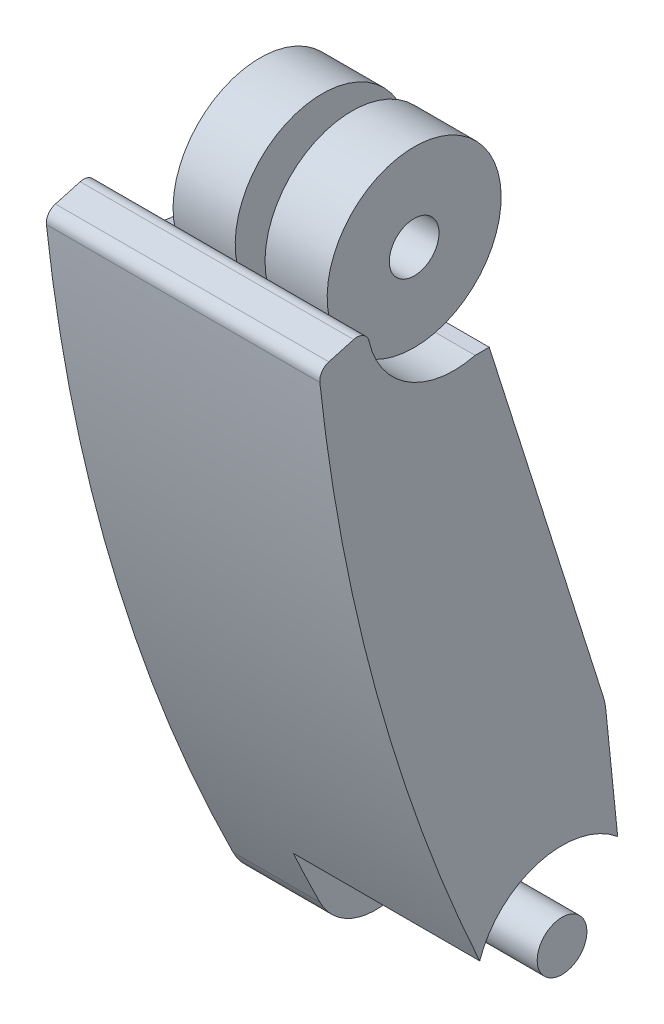
ISO-10303-21;
HEADER;
FILE_DESCRIPTION(('STEP AP214'),'2;1');
FILE_NAME('part.step','',(''),(''),'','','');
FILE_SCHEMA(('AUTOMOTIVE_DESIGN { 1 0 10303 214 1 1 1 1 }'));
ENDSEC;
DATA;
#1=APPLICATION_CONTEXT('core data for automotive mechanical design processes');
#2=APPLICATION_PROTOCOL_DEFINITION('international standard','automotive_design',2000,#1);
#3=PRODUCT_CONTEXT('',#1,'mechanical');
#4=PRODUCT('Part','Part','',(#3));
#5=PRODUCT_RELATED_PRODUCT_CATEGORY('part','',(#4));
#6=PRODUCT_DEFINITION_FORMATION('','',#4);
#7=PRODUCT_DEFINITION_CONTEXT('part definition',#1,'design');
#8=PRODUCT_DEFINITION('design','',#6,#7);
#9=PRODUCT_DEFINITION_SHAPE('','',#8);
#10=(LENGTH_UNIT() NAMED_UNIT(*) SI_UNIT(.MILLI.,.METRE.));
#11=(NAMED_UNIT(*) PLANE_ANGLE_UNIT() SI_UNIT($,.RADIAN.));
#12=(NAMED_UNIT(*) SI_UNIT($,.STERADIAN.) SOLID_ANGLE_UNIT());
#13=UNCERTAINTY_MEASURE_WITH_UNIT(LENGTH_MEASURE(1.E-05),#10,'distance_accuracy_value','');
#14=(GEOMETRIC_REPRESENTATION_CONTEXT(3) GLOBAL_UNCERTAINTY_ASSIGNED_CONTEXT((#13)) GLOBAL_UNIT_ASSIGNED_CONTEXT((#10,
#11,#12)) REPRESENTATION_CONTEXT('',''));
#15=CARTESIAN_POINT('',(0.,0.,0.));
#16=DIRECTION('',(0.,0.,1.));
#17=DIRECTION('',(1.,0.,0.));
#18=AXIS2_PLACEMENT_3D('',#15,#16,#17);
#19=CARTESIAN_POINT('',(-110.,-256.106182296879,-68.0998584689523));
#20=DIRECTION('',(1.,0.,0.));
#21=DIRECTION('',(0.,0.,-1.));
#22=AXIS2_PLACEMENT_3D('',#19,#20,#21);
#23=CYLINDRICAL_SURFACE('',#22,25.);
#24=CARTESIAN_POINT('',(-75.,-256.106182296879,-68.0998584689523));
#25=DIRECTION('',(1.,0.,0.));
#26=DIRECTION('',(0.,1.,0.));
#27=AXIS2_PLACEMENT_3D('',#24,#25,#26);
#28=CIRCLE('',#27,25.);
#29=CARTESIAN_POINT('',(-75.,-267.253741450657,-45.7228183404405));
#30=VERTEX_POINT('',#29);
#31=CARTESIAN_POINT('',(-75.,-253.563610292641,-92.9702289447467));
#32=VERTEX_POINT('',#31);
#33=EDGE_CURVE('E149',#30,#32,#28,.T.);
#34=ORIENTED_EDGE('',*,*,#33,.F.);
#35=DIRECTION('',(1.,0.,0.));
#36=VECTOR('',#35,1.);
#37=CARTESIAN_POINT('',(-110.,-267.253741450657,-45.7228183404405));
#38=LINE('',#37,#36);
#39=CARTESIAN_POINT('',(-110.,-267.253741450657,-45.7228183404405));
#40=VERTEX_POINT('',#39);
#41=EDGE_CURVE('E246',#40,#30,#38,.T.);
#42=ORIENTED_EDGE('',*,*,#41,.F.);
#43=CARTESIAN_POINT('',(-110.,-256.106182296879,-68.0998584689523));
#44=DIRECTION('',(1.,0.,0.));
#45=DIRECTION('',(0.,0.,-1.));
#46=AXIS2_PLACEMENT_3D('',#43,#44,#45);
#47=CIRCLE('',#46,25.);
#48=CARTESIAN_POINT('',(-110.,-253.563610292641,-92.9702289447467));
#49=VERTEX_POINT('',#48);
#50=EDGE_CURVE('E218',#49,#40,#47,.F.);
#51=ORIENTED_EDGE('',*,*,#50,.F.);
#52=DIRECTION('',(1.,0.,0.));
#53=VECTOR('',#52,1.);
#54=CARTESIAN_POINT('',(-110.,-253.563610292641,-92.9702289447467));
#55=LINE('',#54,#53);
#56=EDGE_CURVE('E249',#49,#32,#55,.T.);
#57=ORIENTED_EDGE('',*,*,#56,.T.);
#58=EDGE_LOOP('',(#34,#42,#51,#57));
#59=FACE_BOUND('',#58,.T.);
#60=ADVANCED_FACE('F35',(#59),#23,.T.);
#61=CARTESIAN_POINT('',(-110.,1.0746665770144,-24.6023094727555));
#62=DIRECTION('',(1.,0.,0.));
#63=DIRECTION('',(0.,0.,-1.));
#64=AXIS2_PLACEMENT_3D('',#61,#62,#63);
#65=CYLINDRICAL_SURFACE('',#64,35.);
#66=CARTESIAN_POINT('',(-53.,1.0746665770144,-24.6023094727555));
#67=DIRECTION('',(1.,0.,0.));
#68=DIRECTION('',(0.,0.,-1.));
#69=AXIS2_PLACEMENT_3D('',#66,#67,#68);
#70=CIRCLE('',#69,35.);
#71=CARTESIAN_POINT('',(-53.,-6.63922647531692,9.53704983548571));
#72=VERTEX_POINT('',#71);
#73=CARTESIAN_POINT('',(-53.,-32.8723925034225,-33.1227073384264));
#74=VERTEX_POINT('',#73);
#75=EDGE_CURVE('E56',#72,#74,#70,.T.);
#76=ORIENTED_EDGE('',*,*,#75,.F.);
#77=DIRECTION('',(1.,0.,0.));
#78=VECTOR('',#77,1.);
#79=CARTESIAN_POINT('',(-110.,-6.63922647531692,9.53704983548571));
#80=LINE('',#79,#78);
#81=CARTESIAN_POINT('',(-41.,-6.63922647531692,9.53704983548571));
#82=VERTEX_POINT('',#81);
#83=EDGE_CURVE('E271',#72,#82,#80,.T.);
#84=ORIENTED_EDGE('',*,*,#83,.T.);
#85=CARTESIAN_POINT('',(-41.,1.0746665770144,-24.6023094727555));
#86=DIRECTION('',(1.,0.,0.));
#87=DIRECTION('',(0.,0.,-1.));
#88=AXIS2_PLACEMENT_3D('',#85,#86,#87);
#89=CIRCLE('',#88,35.);
#90=CARTESIAN_POINT('',(-41.,-32.8723925034225,-33.1227073384264));
#91=VERTEX_POINT('',#90);
#92=EDGE_CURVE('E189',#82,#91,#89,.T.);
#93=ORIENTED_EDGE('',*,*,#92,.T.);
#94=DIRECTION('',(1.,0.,0.));
#95=VECTOR('',#94,1.);
#96=CARTESIAN_POINT('',(-110.,-32.8723925034225,-33.1227073384264));
#97=LINE('',#96,#95);
#98=EDGE_CURVE('E265',#74,#91,#97,.T.);
#99=ORIENTED_EDGE('',*,*,#98,.F.);
#100=EDGE_LOOP('',(#76,#84,#93,#99));
#101=FACE_BOUND('',#100,.T.);
#102=ADVANCED_FACE('F310',(#101),#65,.F.);
#103=CARTESIAN_POINT('',(-16.,1.0746665770144,-24.6023094727555));
#104=DIRECTION('',(1.,0.,0.));
#105=DIRECTION('',(0.,0.,-1.));
#106=AXIS2_PLACEMENT_3D('',#103,#104,#105);
#107=CIRCLE('',#106,35.);
#108=CARTESIAN_POINT('',(-16.,-6.63922647531692,9.53704983548571));
#109=VERTEX_POINT('',#108);
#110=CARTESIAN_POINT('',(-16.,-32.8723925034225,-33.1227073384264));
#111=VERTEX_POINT('',#110);
#112=EDGE_CURVE('E194',#109,#111,#107,.T.);
#113=ORIENTED_EDGE('',*,*,#112,.F.);
#114=CARTESIAN_POINT('',(0.,-6.63922647531692,9.53704983548571));
#115=VERTEX_POINT('',#114);
#116=EDGE_CURVE('E263',#109,#115,#80,.T.);
#117=ORIENTED_EDGE('',*,*,#116,.T.);
#118=CARTESIAN_POINT('',(0.,1.0746665770144,-24.6023094727555));
#119=DIRECTION('',(1.,0.,0.));
#120=DIRECTION('',(0.,0.,-1.));
#121=AXIS2_PLACEMENT_3D('',#118,#119,#120);
#122=CIRCLE('',#121,35.);
#123=CARTESIAN_POINT('',(0.,-32.8723925034225,-33.1227073384264));
#124=VERTEX_POINT('',#123);
#125=EDGE_CURVE('E232',#115,#124,#122,.T.);
#126=ORIENTED_EDGE('',*,*,#125,.T.);
#127=EDGE_CURVE('E259',#111,#124,#97,.T.);
#128=ORIENTED_EDGE('',*,*,#127,.F.);
#129=EDGE_LOOP('',(#113,#117,#126,#128));
#130=FACE_BOUND('',#129,.T.);
#131=ADVANCED_FACE('F295',(#130),#65,.F.);
#132=CARTESIAN_POINT('',(6.71572875253808,-256.106182296879,-68.0998584689525));
#133=DIRECTION('',(1.,0.,0.));
#134=DIRECTION('',(0.,0.,-1.));
#135=AXIS2_PLACEMENT_3D('',#132,#133,#134);
#136=CYLINDRICAL_SURFACE('',#135,10.);
#137=CARTESIAN_POINT('',(0.,-256.106182296879,-68.0998584689525));
#138=DIRECTION('',(-1.,0.,0.));
#139=DIRECTION('',(0.,0.,1.));
#140=AXIS2_PLACEMENT_3D('',#137,#138,#139);
#141=CIRCLE('',#140,10.);
#142=CARTESIAN_POINT('',(0.,-256.106182296879,-58.0998584689525));
#143=VERTEX_POINT('',#142);
#144=EDGE_CURVE('E287',#143,#143,#141,.F.);
#145=ORIENTED_EDGE('',*,*,#144,.F.);
#146=EDGE_LOOP('',(#145));
#147=FACE_BOUND('',#146,.T.);
#148=CARTESIAN_POINT('',(-75.,-256.106182296879,-68.0998584689525));
#149=DIRECTION('',(-1.,0.,0.));
#150=DIRECTION('',(0.,-1.,0.));
#151=AXIS2_PLACEMENT_3D('',#148,#149,#150);
#152=CIRCLE('',#151,10.);
#153=CARTESIAN_POINT('',(-75.,-266.106182296879,-68.0998584689525));
#154=VERTEX_POINT('',#153);
#155=EDGE_CURVE('E160',#154,#154,#152,.T.);
#156=ORIENTED_EDGE('',*,*,#155,.F.);
#157=EDGE_LOOP('',(#156));
#158=FACE_BOUND('',#157,.T.);
#159=ADVANCED_FACE('F37',(#147,#158),#136,.T.);
#160=CARTESIAN_POINT('',(-63.9949493661167,-256.106182296879,-68.0998584689525));
#161=DIRECTION('',(1.,0.,0.));
#162=DIRECTION('',(0.,1.,0.));
#163=AXIS2_PLACEMENT_3D('',#160,#161,#162);
#164=CYLINDRICAL_SURFACE('',#163,35.);
#165=CARTESIAN_POINT('',(0.,-256.106182296879,-68.0998584689525));
#166=DIRECTION('',(-1.,0.,0.));
#167=DIRECTION('',(0.,0.,1.));
#168=AXIS2_PLACEMENT_3D('',#165,#166,#167);
#169=CIRCLE('',#168,35.);
#170=CARTESIAN_POINT('',(0.,-244.778224967122,-34.983738787817));
#171=VERTEX_POINT('',#170);
#172=CARTESIAN_POINT('',(0.,-229.195723340771,-90.4790273268793));
#173=VERTEX_POINT('',#172);
#174=EDGE_CURVE('E166',#171,#173,#169,.T.);
#175=ORIENTED_EDGE('',*,*,#174,.F.);
#176=DIRECTION('',(-1.,0.,0.));
#177=VECTOR('',#176,1.);
#178=CARTESIAN_POINT('',(-20.,-244.778224967121,-34.9837387878187));
#179=LINE('',#178,#177);
#180=CARTESIAN_POINT('',(-75.,-244.778224967124,-34.9837387878178));
#181=VERTEX_POINT('',#180);
#182=EDGE_CURVE('E11',#171,#181,#179,.T.);
#183=ORIENTED_EDGE('',*,*,#182,.T.);
#184=CARTESIAN_POINT('',(-75.,-256.106182296879,-68.0998584689525));
#185=DIRECTION('',(-1.,0.,0.));
#186=DIRECTION('',(0.,-1.,0.));
#187=AXIS2_PLACEMENT_3D('',#184,#185,#186);
#188=CIRCLE('',#187,35.);
#189=CARTESIAN_POINT('',(-75.,-229.195723340771,-90.4790273268793));
#190=VERTEX_POINT('',#189);
#191=EDGE_CURVE('E50',#181,#190,#188,.T.);
#192=ORIENTED_EDGE('',*,*,#191,.T.);
#193=DIRECTION('',(-1.,0.,0.));
#194=VECTOR('',#193,1.);
#195=CARTESIAN_POINT('',(133.994949366117,-229.195723340771,-90.4790273268793));
#196=LINE('',#195,#194);
#197=EDGE_CURVE('E153',#190,#173,#196,.F.);
#198=ORIENTED_EDGE('',*,*,#197,.T.);
#199=EDGE_LOOP('',(#175,#183,#192,#198));
#200=FACE_BOUND('',#199,.T.);
#201=ADVANCED_FACE('F156',(#200),#164,.F.);
#202=CARTESIAN_POINT('',(0.,0.,0.));
#203=DIRECTION('',(-1.,0.,0.));
#204=DIRECTION('',(0.,0.,-1.));
#205=AXIS2_PLACEMENT_3D('',#202,#203,#204);
#206=PLANE('',#205);
#207=CARTESIAN_POINT('',(0.,70.5355625849161,-723.783791789033));
#208=DIRECTION('',(1.,0.,0.));
#209=DIRECTION('',(0.,0.,-1.));
#210=AXIS2_PLACEMENT_3D('',#207,#208,#209);
#211=CIRCLE('',#210,757.540954427475);
#212=CARTESIAN_POINT('',(0.,-11.0599857614775,29.34997064958));
#213=VERTEX_POINT('',#212);
#214=EDGE_CURVE('E202',#213,#171,#211,.T.);
#215=ORIENTED_EDGE('',*,*,#214,.T.);
#216=ORIENTED_EDGE('',*,*,#174,.T.);
#217=DIRECTION('',(0.,0.994814819031776,0.101702880169517));
#218=VECTOR('',#217,1.);
#219=CARTESIAN_POINT('',(0.,6.78358332876531,-66.3541603772135));
#220=LINE('',#219,#218);
#221=CARTESIAN_POINT('',(0.,-182.515445717125,-85.7067635943608));
#222=VERTEX_POINT('',#221);
#223=EDGE_CURVE('E165',#173,#222,#220,.T.);
#224=ORIENTED_EDGE('',*,*,#223,.T.);
#225=CARTESIAN_POINT('',(0.,-185.058017721363,-60.8363931185664));
#226=DIRECTION('',(1.,0.,0.));
#227=DIRECTION('',(0.,0.,-1.));
#228=AXIS2_PLACEMENT_3D('',#225,#226,#227);
#229=CIRCLE('',#228,25.);
#230=CARTESIAN_POINT('',(0.,-177.502040478959,-84.6671968799226));
#231=VERTEX_POINT('',#230);
#232=EDGE_CURVE('E239',#231,#222,#229,.F.);
#233=ORIENTED_EDGE('',*,*,#232,.F.);
#234=DIRECTION('',(0.,-0.953232150454251,-0.302239089696161));
#235=VECTOR('',#234,1.);
#236=CARTESIAN_POINT('',(0.,8.17842021745939,-25.793927248274));
#237=LINE('',#236,#235);
#238=CARTESIAN_POINT('',(0.,-32.8723925034226,-38.8098124784716));
#239=VERTEX_POINT('',#238);
#240=EDGE_CURVE('E237',#239,#231,#237,.T.);
#241=ORIENTED_EDGE('',*,*,#240,.F.);
#242=DIRECTION('',(0.,0.,-1.));
#243=VECTOR('',#242,1.);
#244=CARTESIAN_POINT('',(0.,-32.8723925034216,8.42266637413975E-13));
#245=LINE('',#244,#243);
#246=EDGE_CURVE('E235',#124,#239,#245,.T.);
#247=ORIENTED_EDGE('',*,*,#246,.F.);
#248=ORIENTED_EDGE('',*,*,#125,.F.);
#249=CARTESIAN_POINT('',(0.,-7.74121119707855,14.4141011652344));
#250=DIRECTION('',(1.,0.,0.));
#251=DIRECTION('',(0.,0.,-1.));
#252=AXIS2_PLACEMENT_3D('',#249,#250,#251);
#253=CIRCLE('',#252,5.);
#254=CARTESIAN_POINT('',(0.,-2.92514218657506,15.7577824094542));
#255=VERTEX_POINT('',#254);
#256=EDGE_CURVE('E229',#115,#255,#253,.T.);
#257=ORIENTED_EDGE('',*,*,#256,.T.);
#258=DIRECTION('',(0.,0.268736248843945,-0.9632138021007));
#259=VECTOR('',#258,1.);
#260=CARTESIAN_POINT('',(0.,1.36501844696715,0.380839577091513));
#261=LINE('',#260,#259);
#262=CARTESIAN_POINT('',(0.,-5.70536139057118,25.7227406972718));
#263=VERTEX_POINT('',#262);
#264=EDGE_CURVE('E226',#263,#255,#261,.T.);
#265=ORIENTED_EDGE('',*,*,#264,.F.);
#266=CARTESIAN_POINT('',(0.,-10.5214304010745,24.3790594530505));
#267=DIRECTION('',(1.,0.,0.));
#268=DIRECTION('',(0.,0.,-1.));
#269=AXIS2_PLACEMENT_3D('',#266,#267,#268);
#270=CIRCLE('',#269,5.0000000000001);
#271=EDGE_CURVE('E197',#213,#263,#270,.F.);
#272=ORIENTED_EDGE('',*,*,#271,.F.);
#273=EDGE_LOOP('',(#215,#216,#224,#233,#241,#247,#248,#257,#265,#272));
#274=FACE_BOUND('',#273,.T.);
#275=ADVANCED_FACE('F347',(#274),#206,.F.);
#276=CARTESIAN_POINT('',(-110.,-10.5214304010745,24.3790594530505));
#277=DIRECTION('',(1.,0.,0.));
#278=DIRECTION('',(0.,0.,-1.));
#279=AXIS2_PLACEMENT_3D('',#276,#277,#278);
#280=CYLINDRICAL_SURFACE('',#279,5.0000000000001);
#281=ORIENTED_EDGE('',*,*,#271,.T.);
#282=DIRECTION('',(1.,0.,0.));
#283=VECTOR('',#282,1.);
#284=CARTESIAN_POINT('',(-110.,-5.70536139057118,25.7227406972718));
#285=LINE('',#284,#283);
#286=CARTESIAN_POINT('',(-110.,-5.70536139057118,25.7227406972718));
#287=VERTEX_POINT('',#286);
#288=EDGE_CURVE('E273',#287,#263,#285,.T.);
#289=ORIENTED_EDGE('',*,*,#288,.F.);
#290=CARTESIAN_POINT('',(-110.,-10.5214304010745,24.3790594530505));
#291=DIRECTION('',(1.,0.,0.));
#292=DIRECTION('',(0.,0.,-1.));
#293=AXIS2_PLACEMENT_3D('',#290,#291,#292);
#294=CIRCLE('',#293,5.0000000000001);
#295=CARTESIAN_POINT('',(-110.,-11.0599857614775,29.34997064958));
#296=VERTEX_POINT('',#295);
#297=EDGE_CURVE('E198',#296,#287,#294,.F.);
#298=ORIENTED_EDGE('',*,*,#297,.F.);
#299=DIRECTION('',(1.,0.,0.));
#300=VECTOR('',#299,1.);
#301=CARTESIAN_POINT('',(-110.,-11.0599857614775,29.34997064958));
#302=LINE('',#301,#300);
#303=EDGE_CURVE('E223',#296,#213,#302,.T.);
#304=ORIENTED_EDGE('',*,*,#303,.T.);
#305=EDGE_LOOP('',(#281,#289,#298,#304));
#306=FACE_BOUND('',#305,.T.);
#307=ADVANCED_FACE('F344',(#306),#280,.T.);
#308=CARTESIAN_POINT('',(-110.,1.36501844696715,0.380839577091513));
#309=DIRECTION('',(0.,-0.963213802100699,-0.268736248843945));
#310=DIRECTION('',(0.,0.268736248843945,-0.963213802100699));
#311=AXIS2_PLACEMENT_3D('',#308,#309,#310);
#312=PLANE('',#311);
#313=ORIENTED_EDGE('',*,*,#264,.T.);
#314=DIRECTION('',(1.,0.,0.));
#315=VECTOR('',#314,1.);
#316=CARTESIAN_POINT('',(-110.,-2.92514218657506,15.7577824094542));
#317=LINE('',#316,#315);
#318=CARTESIAN_POINT('',(-110.,-2.92514218657506,15.7577824094542));
#319=VERTEX_POINT('',#318);
#320=EDGE_CURVE('E270',#319,#255,#317,.T.);
#321=ORIENTED_EDGE('',*,*,#320,.F.);
#322=DIRECTION('',(0.,0.268736248843945,-0.9632138021007));
#323=VECTOR('',#322,1.);
#324=CARTESIAN_POINT('',(-110.,1.36501844696715,0.380839577091513));
#325=LINE('',#324,#323);
#326=EDGE_CURVE('E201',#287,#319,#325,.T.);
#327=ORIENTED_EDGE('',*,*,#326,.F.);
#328=ORIENTED_EDGE('',*,*,#288,.T.);
#329=EDGE_LOOP('',(#313,#321,#327,#328));
#330=FACE_BOUND('',#329,.T.);
#331=ADVANCED_FACE('F340',(#330),#312,.F.);
#332=CARTESIAN_POINT('',(-110.,-7.74121119707855,14.4141011652344));
#333=DIRECTION('',(1.,0.,0.));
#334=DIRECTION('',(0.,0.,-1.));
#335=AXIS2_PLACEMENT_3D('',#332,#333,#334);
#336=CYLINDRICAL_SURFACE('',#335,5.);
#337=ORIENTED_EDGE('',*,*,#256,.F.);
#338=ORIENTED_EDGE('',*,*,#116,.F.);
#339=DIRECTION('',(1.,0.,0.));
#340=VECTOR('',#339,1.);
#341=CARTESIAN_POINT('',(-28.5,-6.63922647531693,9.53704983548571));
#342=LINE('',#341,#340);
#343=EDGE_CURVE('E192',#82,#109,#342,.T.);
#344=ORIENTED_EDGE('',*,*,#343,.F.);
#345=ORIENTED_EDGE('',*,*,#83,.F.);
#346=DIRECTION('',(1.,0.,0.));
#347=VECTOR('',#346,1.);
#348=CARTESIAN_POINT('',(-65.5,-6.63922647531693,9.53704983548571));
#349=LINE('',#348,#347);
#350=CARTESIAN_POINT('',(-78.,-6.63922647531692,9.53704983548571));
#351=VERTEX_POINT('',#350);
#352=EDGE_CURVE('E184',#351,#72,#349,.T.);
#353=ORIENTED_EDGE('',*,*,#352,.F.);
#354=CARTESIAN_POINT('',(-110.,-6.63922647531692,9.53704983548571));
#355=VERTEX_POINT('',#354);
#356=EDGE_CURVE('E267',#355,#351,#80,.T.);
#357=ORIENTED_EDGE('',*,*,#356,.F.);
#358=CARTESIAN_POINT('',(-110.,-7.74121119707855,14.4141011652344));
#359=DIRECTION('',(1.,0.,0.));
#360=DIRECTION('',(0.,0.,-1.));
#361=AXIS2_PLACEMENT_3D('',#358,#359,#360);
#362=CIRCLE('',#361,5.);
#363=EDGE_CURVE('E204',#355,#319,#362,.T.);
#364=ORIENTED_EDGE('',*,*,#363,.T.);
#365=ORIENTED_EDGE('',*,*,#320,.T.);
#366=EDGE_LOOP('',(#337,#338,#344,#345,#353,#357,#364,#365));
#367=FACE_BOUND('',#366,.T.);
#368=ADVANCED_FACE('F336',(#367),#336,.T.);
#369=ORIENTED_EDGE('',*,*,#356,.T.);
#370=CARTESIAN_POINT('',(-78.,1.0746665770144,-24.6023094727555));
#371=DIRECTION('',(1.,0.,0.));
#372=DIRECTION('',(0.,0.,-1.));
#373=AXIS2_PLACEMENT_3D('',#370,#371,#372);
#374=CIRCLE('',#373,35.);
#375=CARTESIAN_POINT('',(-78.,-32.8723925034225,-33.1227073384264));
#376=VERTEX_POINT('',#375);
#377=EDGE_CURVE('E181',#351,#376,#374,.T.);
#378=ORIENTED_EDGE('',*,*,#377,.T.);
#379=CARTESIAN_POINT('',(-110.,-32.8723925034225,-33.1227073384264));
#380=VERTEX_POINT('',#379);
#381=EDGE_CURVE('E260',#380,#376,#97,.T.);
#382=ORIENTED_EDGE('',*,*,#381,.F.);
#383=CARTESIAN_POINT('',(-110.,1.0746665770144,-24.6023094727555));
#384=DIRECTION('',(1.,0.,0.));
#385=DIRECTION('',(0.,0.,-1.));
#386=AXIS2_PLACEMENT_3D('',#383,#384,#385);
#387=CIRCLE('',#386,35.);
#388=EDGE_CURVE('E207',#355,#380,#387,.T.);
#389=ORIENTED_EDGE('',*,*,#388,.F.);
#390=EDGE_LOOP('',(#369,#378,#382,#389));
#391=FACE_BOUND('',#390,.T.);
#392=ADVANCED_FACE('F317',(#391),#65,.F.);
#393=CARTESIAN_POINT('',(-110.,-32.8723925034216,8.42266637413975E-13));
#394=DIRECTION('',(0.,-1.,0.));
#395=DIRECTION('',(0.,0.,-1.));
#396=AXIS2_PLACEMENT_3D('',#393,#394,#395);
#397=PLANE('',#396);
#398=ORIENTED_EDGE('',*,*,#246,.T.);
#399=DIRECTION('',(1.,0.,0.));
#400=VECTOR('',#399,1.);
#401=CARTESIAN_POINT('',(-110.,-32.8723925034226,-38.8098124784716));
#402=LINE('',#401,#400);
#403=CARTESIAN_POINT('',(-110.,-32.8723925034226,-38.8098124784716));
#404=VERTEX_POINT('',#403);
#405=EDGE_CURVE('E256',#404,#239,#402,.T.);
#406=ORIENTED_EDGE('',*,*,#405,.F.);
#407=DIRECTION('',(0.,0.,-1.));
#408=VECTOR('',#407,1.);
#409=CARTESIAN_POINT('',(-110.,-32.8723925034216,8.42266637413975E-13));
#410=LINE('',#409,#408);
#411=EDGE_CURVE('E209',#380,#404,#410,.T.);
#412=ORIENTED_EDGE('',*,*,#411,.F.);
#413=ORIENTED_EDGE('',*,*,#381,.T.);
#414=EDGE_CURVE('E264',#376,#74,#97,.T.);
#415=ORIENTED_EDGE('',*,*,#414,.T.);
#416=ORIENTED_EDGE('',*,*,#98,.T.);
#417=EDGE_CURVE('E266',#91,#111,#97,.T.);
#418=ORIENTED_EDGE('',*,*,#417,.T.);
#419=ORIENTED_EDGE('',*,*,#127,.T.);
#420=EDGE_LOOP('',(#398,#406,#412,#413,#415,#416,#418,#419));
#421=FACE_BOUND('',#420,.T.);
#422=ADVANCED_FACE('F330',(#421),#397,.F.);
#423=CARTESIAN_POINT('',(-110.,8.17842021745939,-25.793927248274));
#424=DIRECTION('',(0.,-0.302239089696161,0.953232150454251));
#425=DIRECTION('',(0.,-0.953232150454251,-0.302239089696161));
#426=AXIS2_PLACEMENT_3D('',#423,#424,#425);
#427=PLANE('',#426);
#428=ORIENTED_EDGE('',*,*,#240,.T.);
#429=DIRECTION('',(1.,0.,0.));
#430=VECTOR('',#429,1.);
#431=CARTESIAN_POINT('',(-110.,-177.502040478959,-84.6671968799226));
#432=LINE('',#431,#430);
#433=CARTESIAN_POINT('',(-110.,-177.502040478959,-84.6671968799226));
#434=VERTEX_POINT('',#433);
#435=EDGE_CURVE('E253',#434,#231,#432,.T.);
#436=ORIENTED_EDGE('',*,*,#435,.F.);
#437=DIRECTION('',(0.,-0.953232150454251,-0.302239089696161));
#438=VECTOR('',#437,1.);
#439=CARTESIAN_POINT('',(-110.,8.17842021745939,-25.793927248274));
#440=LINE('',#439,#438);
#441=EDGE_CURVE('E211',#404,#434,#440,.T.);
#442=ORIENTED_EDGE('',*,*,#441,.F.);
#443=ORIENTED_EDGE('',*,*,#405,.T.);
#444=EDGE_LOOP('',(#428,#436,#442,#443));
#445=FACE_BOUND('',#444,.T.);
#446=ADVANCED_FACE('F326',(#445),#427,.F.);
#447=CARTESIAN_POINT('',(-110.,-185.058017721363,-60.8363931185664));
#448=DIRECTION('',(1.,0.,0.));
#449=DIRECTION('',(0.,0.,-1.));
#450=AXIS2_PLACEMENT_3D('',#447,#448,#449);
#451=CYLINDRICAL_SURFACE('',#450,25.);
#452=ORIENTED_EDGE('',*,*,#232,.T.);
#453=DIRECTION('',(1.,0.,0.));
#454=VECTOR('',#453,1.);
#455=CARTESIAN_POINT('',(-110.,-182.515445717125,-85.7067635943608));
#456=LINE('',#455,#454);
#457=CARTESIAN_POINT('',(-110.,-182.515445717125,-85.7067635943608));
#458=VERTEX_POINT('',#457);
#459=EDGE_CURVE('E251',#458,#222,#456,.T.);
#460=ORIENTED_EDGE('',*,*,#459,.F.);
#461=CARTESIAN_POINT('',(-110.,-185.058017721363,-60.8363931185664));
#462=DIRECTION('',(1.,0.,0.));
#463=DIRECTION('',(0.,0.,-1.));
#464=AXIS2_PLACEMENT_3D('',#461,#462,#463);
#465=CIRCLE('',#464,25.);
#466=EDGE_CURVE('E213',#434,#458,#465,.F.);
#467=ORIENTED_EDGE('',*,*,#466,.F.);
#468=ORIENTED_EDGE('',*,*,#435,.T.);
#469=EDGE_LOOP('',(#452,#460,#467,#468));
#470=FACE_BOUND('',#469,.T.);
#471=ADVANCED_FACE('F323',(#470),#451,.T.);
#472=CARTESIAN_POINT('',(-110.,6.78358332876531,-66.3541603772135));
#473=DIRECTION('',(0.,0.101702880169517,-0.994814819031776));
#474=DIRECTION('',(0.,0.994814819031776,0.101702880169517));
#475=AXIS2_PLACEMENT_3D('',#472,#473,#474);
#476=PLANE('',#475);
#477=ORIENTED_EDGE('',*,*,#197,.F.);
#478=DIRECTION('',(0.,-0.994814819031776,-0.101702880169517));
#479=VECTOR('',#478,1.);
#480=CARTESIAN_POINT('',(-75.0000000000001,6.78358332876531,-66.3541603772135));
#481=LINE('',#480,#479);
#482=EDGE_CURVE('E146',#190,#32,#481,.T.);
#483=ORIENTED_EDGE('',*,*,#482,.T.);
#484=ORIENTED_EDGE('',*,*,#56,.F.);
#485=DIRECTION('',(0.,0.994814819031776,0.101702880169517));
#486=VECTOR('',#485,1.);
#487=CARTESIAN_POINT('',(-110.,6.78358332876531,-66.3541603772135));
#488=LINE('',#487,#486);
#489=EDGE_CURVE('E215',#49,#458,#488,.T.);
#490=ORIENTED_EDGE('',*,*,#489,.T.);
#491=ORIENTED_EDGE('',*,*,#459,.T.);
#492=ORIENTED_EDGE('',*,*,#223,.F.);
#493=EDGE_LOOP('',(#477,#483,#484,#490,#491,#492));
#494=FACE_BOUND('',#493,.T.);
#495=ADVANCED_FACE('F163',(#494),#476,.T.);
#496=CARTESIAN_POINT('',(-110.,70.5355625849161,-723.783791789033));
#497=DIRECTION('',(1.,0.,0.));
#498=DIRECTION('',(0.,0.,-1.));
#499=AXIS2_PLACEMENT_3D('',#496,#497,#498);
#500=CYLINDRICAL_SURFACE('',#499,757.540954427475);
#501=ORIENTED_EDGE('',*,*,#182,.F.);
#502=ORIENTED_EDGE('',*,*,#214,.F.);
#503=ORIENTED_EDGE('',*,*,#303,.F.);
#504=CARTESIAN_POINT('',(-110.,70.5355625849161,-723.783791789033));
#505=DIRECTION('',(1.,0.,0.));
#506=DIRECTION('',(0.,0.,-1.));
#507=AXIS2_PLACEMENT_3D('',#504,#505,#506);
#508=CIRCLE('',#507,757.540954427475);
#509=EDGE_CURVE('E220',#296,#40,#508,.T.);
#510=ORIENTED_EDGE('',*,*,#509,.T.);
#511=ORIENTED_EDGE('',*,*,#41,.T.);
#512=CARTESIAN_POINT('',(-75.0000000000001,70.5355625849161,-723.783791789033));
#513=DIRECTION('',(1.,0.,0.));
#514=DIRECTION('',(0.,1.,0.));
#515=AXIS2_PLACEMENT_3D('',#512,#513,#514);
#516=CIRCLE('',#515,757.540954427475);
#517=EDGE_CURVE('E43',#30,#181,#516,.F.);
#518=ORIENTED_EDGE('',*,*,#517,.T.);
#519=EDGE_LOOP('',(#501,#502,#503,#510,#511,#518));
#520=FACE_BOUND('',#519,.T.);
#521=ADVANCED_FACE('F278',(#520),#500,.T.);
#522=CARTESIAN_POINT('',(-110.,0.,0.));
#523=DIRECTION('',(-1.,0.,0.));
#524=DIRECTION('',(0.,0.,-1.));
#525=AXIS2_PLACEMENT_3D('',#522,#523,#524);
#526=PLANE('',#525);
#527=ORIENTED_EDGE('',*,*,#297,.T.);
#528=ORIENTED_EDGE('',*,*,#326,.T.);
#529=ORIENTED_EDGE('',*,*,#363,.F.);
#530=ORIENTED_EDGE('',*,*,#388,.T.);
#531=ORIENTED_EDGE('',*,*,#411,.T.);
#532=ORIENTED_EDGE('',*,*,#441,.T.);
#533=ORIENTED_EDGE('',*,*,#466,.T.);
#534=ORIENTED_EDGE('',*,*,#489,.F.);
#535=ORIENTED_EDGE('',*,*,#50,.T.);
#536=ORIENTED_EDGE('',*,*,#509,.F.);
#537=EDGE_LOOP('',(#527,#528,#529,#530,#531,#532,#533,#534,#535,#536));
#538=FACE_BOUND('',#537,.T.);
#539=ADVANCED_FACE('F357',(#538),#526,.T.);
#540=CARTESIAN_POINT('',(-41.,1.0746665770144,-24.6023094727555));
#541=DIRECTION('',(1.,0.,0.));
#542=DIRECTION('',(0.,0.,-1.));
#543=AXIS2_PLACEMENT_3D('',#540,#541,#542);
#544=CYLINDRICAL_SURFACE('',#543,35.);
#545=EDGE_CURVE('E193',#91,#82,#89,.T.);
#546=ORIENTED_EDGE('',*,*,#545,.T.);
#547=ORIENTED_EDGE('',*,*,#343,.T.);
#548=EDGE_CURVE('E188',#111,#109,#107,.T.);
#549=ORIENTED_EDGE('',*,*,#548,.F.);
#550=ORIENTED_EDGE('',*,*,#417,.F.);
#551=EDGE_LOOP('',(#546,#547,#549,#550));
#552=FACE_BOUND('',#551,.T.);
#553=ADVANCED_FACE('F360',(#552),#544,.T.);
#554=CARTESIAN_POINT('',(-41.,0.,0.));
#555=DIRECTION('',(-1.,0.,0.));
#556=DIRECTION('',(0.,0.,-1.));
#557=AXIS2_PLACEMENT_3D('',#554,#555,#556);
#558=PLANE('',#557);
#559=CARTESIAN_POINT('',(-41.,1.0746665770144,-24.6023094727555));
#560=DIRECTION('',(-1.,0.,0.));
#561=DIRECTION('',(0.,0.,1.));
#562=AXIS2_PLACEMENT_3D('',#559,#560,#561);
#563=CIRCLE('',#562,9.99999999999999);
#564=CARTESIAN_POINT('',(-41.,1.0746665770144,-14.6023094727555));
#565=VERTEX_POINT('',#564);
#566=EDGE_CURVE('E177',#565,#565,#563,.F.);
#567=ORIENTED_EDGE('',*,*,#566,.T.);
#568=EDGE_LOOP('',(#567));
#569=FACE_BOUND('',#568,.T.);
#570=ORIENTED_EDGE('',*,*,#92,.F.);
#571=ORIENTED_EDGE('',*,*,#545,.F.);
#572=EDGE_LOOP('',(#570,#571));
#573=FACE_BOUND('',#572,.T.);
#574=ADVANCED_FACE('F364',(#569,#573),#558,.T.);
#575=CARTESIAN_POINT('',(-16.,0.,0.));
#576=DIRECTION('',(-1.,0.,0.));
#577=DIRECTION('',(0.,0.,-1.));
#578=AXIS2_PLACEMENT_3D('',#575,#576,#577);
#579=PLANE('',#578);
#580=CARTESIAN_POINT('',(-16.,1.0746665770144,-24.6023094727555));
#581=DIRECTION('',(-1.,0.,0.));
#582=DIRECTION('',(0.,0.,1.));
#583=AXIS2_PLACEMENT_3D('',#580,#581,#582);
#584=CIRCLE('',#583,9.99999999999999);
#585=CARTESIAN_POINT('',(-16.,1.0746665770144,-14.6023094727555));
#586=VERTEX_POINT('',#585);
#587=EDGE_CURVE('E174',#586,#586,#584,.F.);
#588=ORIENTED_EDGE('',*,*,#587,.F.);
#589=EDGE_LOOP('',(#588));
#590=FACE_BOUND('',#589,.T.);
#591=ORIENTED_EDGE('',*,*,#112,.T.);
#592=ORIENTED_EDGE('',*,*,#548,.T.);
#593=EDGE_LOOP('',(#591,#592));
#594=FACE_BOUND('',#593,.T.);
#595=ADVANCED_FACE('F366',(#590,#594),#579,.F.);
#596=CARTESIAN_POINT('',(-78.,1.0746665770144,-24.6023094727555));
#597=DIRECTION('',(1.,0.,0.));
#598=DIRECTION('',(0.,0.,-1.));
#599=AXIS2_PLACEMENT_3D('',#596,#597,#598);
#600=CYLINDRICAL_SURFACE('',#599,35.);
#601=EDGE_CURVE('E185',#376,#351,#374,.T.);
#602=ORIENTED_EDGE('',*,*,#601,.T.);
#603=ORIENTED_EDGE('',*,*,#352,.T.);
#604=EDGE_CURVE('E180',#74,#72,#70,.T.);
#605=ORIENTED_EDGE('',*,*,#604,.F.);
#606=ORIENTED_EDGE('',*,*,#414,.F.);
#607=EDGE_LOOP('',(#602,#603,#605,#606));
#608=FACE_BOUND('',#607,.T.);
#609=ADVANCED_FACE('F369',(#608),#600,.T.);
#610=CARTESIAN_POINT('',(-78.,0.,0.));
#611=DIRECTION('',(-1.,0.,0.));
#612=DIRECTION('',(0.,0.,-1.));
#613=AXIS2_PLACEMENT_3D('',#610,#611,#612);
#614=PLANE('',#613);
#615=CARTESIAN_POINT('',(-78.,1.0746665770144,-24.6023094727555));
#616=DIRECTION('',(1.,0.,0.));
#617=DIRECTION('',(0.,0.,-1.));
#618=AXIS2_PLACEMENT_3D('',#615,#616,#617);
#619=CIRCLE('',#618,9.99999999999999);
#620=CARTESIAN_POINT('',(-78.,1.0746665770144,-34.6023094727555));
#621=VERTEX_POINT('',#620);
#622=EDGE_CURVE('E168',#621,#621,#619,.T.);
#623=ORIENTED_EDGE('',*,*,#622,.T.);
#624=EDGE_LOOP('',(#623));
#625=FACE_BOUND('',#624,.T.);
#626=ORIENTED_EDGE('',*,*,#377,.F.);
#627=ORIENTED_EDGE('',*,*,#601,.F.);
#628=EDGE_LOOP('',(#626,#627));
#629=FACE_BOUND('',#628,.T.);
#630=ADVANCED_FACE('F376',(#625,#629),#614,.T.);
#631=CARTESIAN_POINT('',(-53.,0.,0.));
#632=DIRECTION('',(-1.,0.,0.));
#633=DIRECTION('',(0.,0.,-1.));
#634=AXIS2_PLACEMENT_3D('',#631,#632,#633);
#635=PLANE('',#634);
#636=CARTESIAN_POINT('',(-53.,1.0746665770144,-24.6023094727555));
#637=DIRECTION('',(-1.,0.,0.));
#638=DIRECTION('',(0.,0.,1.));
#639=AXIS2_PLACEMENT_3D('',#636,#637,#638);
#640=CIRCLE('',#639,9.99999999999999);
#641=CARTESIAN_POINT('',(-53.,1.0746665770144,-14.6023094727555));
#642=VERTEX_POINT('',#641);
#643=EDGE_CURVE('E173',#642,#642,#640,.F.);
#644=ORIENTED_EDGE('',*,*,#643,.F.);
#645=EDGE_LOOP('',(#644));
#646=FACE_BOUND('',#645,.T.);
#647=ORIENTED_EDGE('',*,*,#75,.T.);
#648=ORIENTED_EDGE('',*,*,#604,.T.);
#649=EDGE_LOOP('',(#647,#648));
#650=FACE_BOUND('',#649,.T.);
#651=ADVANCED_FACE('F378',(#646,#650),#635,.F.);
#652=CARTESIAN_POINT('',(110.,1.0746665770144,-24.6023094727555));
#653=DIRECTION('',(-1.,0.,0.));
#654=DIRECTION('',(0.,0.,1.));
#655=AXIS2_PLACEMENT_3D('',#652,#653,#654);
#656=CYLINDRICAL_SURFACE('',#655,9.99999999999999);
#657=ORIENTED_EDGE('',*,*,#622,.F.);
#658=EDGE_LOOP('',(#657));
#659=FACE_BOUND('',#658,.T.);
#660=ORIENTED_EDGE('',*,*,#643,.T.);
#661=EDGE_LOOP('',(#660));
#662=FACE_BOUND('',#661,.T.);
#663=ADVANCED_FACE('F306',(#659,#662),#656,.F.);
#664=ORIENTED_EDGE('',*,*,#566,.F.);
#665=EDGE_LOOP('',(#664));
#666=FACE_BOUND('',#665,.T.);
#667=ORIENTED_EDGE('',*,*,#587,.T.);
#668=EDGE_LOOP('',(#667));
#669=FACE_BOUND('',#668,.T.);
#670=ADVANCED_FACE('F299',(#666,#669),#656,.F.);
#671=CARTESIAN_POINT('',(-75.,-256.106182296879,-68.0998584689525));
#672=DIRECTION('',(1.,0.,0.));
#673=DIRECTION('',(0.,-1.,0.));
#674=AXIS2_PLACEMENT_3D('',#671,#672,#673);
#675=PLANE('',#674);
#676=ORIENTED_EDGE('',*,*,#155,.T.);
#677=EDGE_LOOP('',(#676));
#678=FACE_BOUND('',#677,.T.);
#679=ORIENTED_EDGE('',*,*,#191,.F.);
#680=ORIENTED_EDGE('',*,*,#517,.F.);
#681=ORIENTED_EDGE('',*,*,#33,.T.);
#682=ORIENTED_EDGE('',*,*,#482,.F.);
#683=EDGE_LOOP('',(#679,#680,#681,#682));
#684=FACE_BOUND('',#683,.T.);
#685=ADVANCED_FACE('F147',(#678,#684),#675,.T.);
#686=CARTESIAN_POINT('',(0.,44.909074188764,-93.0998584689523));
#687=DIRECTION('',(-1.,0.,0.));
#688=DIRECTION('',(0.,0.,1.));
#689=AXIS2_PLACEMENT_3D('',#686,#687,#688);
#690=PLANE('',#689);
#691=ORIENTED_EDGE('',*,*,#144,.T.);
#692=EDGE_LOOP('',(#691));
#693=FACE_BOUND('',#692,.T.);
#694=ADVANCED_FACE('F291',(#693),#690,.F.);
#695=CLOSED_SHELL('',(#60,#102,#131,#159,#201,#275,#307,#331,#368,#392,#422,#446,#471,#495,#521,
#539,#553,#574,#595,#609,#630,#651,#663,#670,#685,#694));
#696=MANIFOLD_SOLID_BREP('B2',#695);
#697=ADVANCED_BREP_SHAPE_REPRESENTATION('',(#18,#696),#14);
#698=SHAPE_DEFINITION_REPRESENTATION(#9,#697);
ENDSEC;
END-ISO-10303-21;
